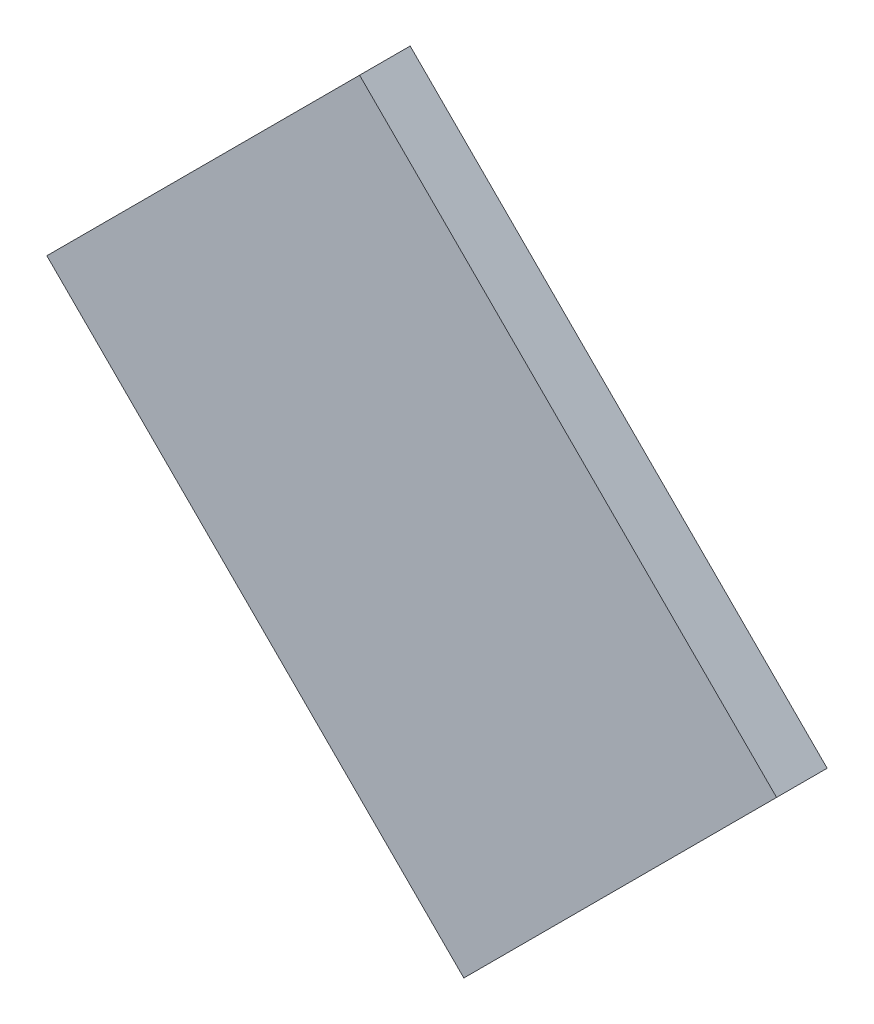
ISO-10303-21;
HEADER;
FILE_DESCRIPTION(('STEP AP214'),'2;1');
FILE_NAME('part.step','',(''),(''),'','','');
FILE_SCHEMA(('AUTOMOTIVE_DESIGN { 1 0 10303 214 1 1 1 1 }'));
ENDSEC;
DATA;
#1=APPLICATION_CONTEXT('core data for automotive mechanical design processes');
#2=APPLICATION_PROTOCOL_DEFINITION('international standard','automotive_design',2000,#1);
#3=PRODUCT_CONTEXT('',#1,'mechanical');
#4=PRODUCT('Part','Part','',(#3));
#5=PRODUCT_RELATED_PRODUCT_CATEGORY('part','',(#4));
#6=PRODUCT_DEFINITION_FORMATION('','',#4);
#7=PRODUCT_DEFINITION_CONTEXT('part definition',#1,'design');
#8=PRODUCT_DEFINITION('design','',#6,#7);
#9=PRODUCT_DEFINITION_SHAPE('','',#8);
#10=(LENGTH_UNIT() NAMED_UNIT(*) SI_UNIT(.MILLI.,.METRE.));
#11=(NAMED_UNIT(*) PLANE_ANGLE_UNIT() SI_UNIT($,.RADIAN.));
#12=(NAMED_UNIT(*) SI_UNIT($,.STERADIAN.) SOLID_ANGLE_UNIT());
#13=UNCERTAINTY_MEASURE_WITH_UNIT(LENGTH_MEASURE(1.E-05),#10,'distance_accuracy_value','');
#14=(GEOMETRIC_REPRESENTATION_CONTEXT(3) GLOBAL_UNCERTAINTY_ASSIGNED_CONTEXT((#13)) GLOBAL_UNIT_ASSIGNED_CONTEXT((#10,
#11,#12)) REPRESENTATION_CONTEXT('',''));
#15=CARTESIAN_POINT('',(0.,0.,0.));
#16=DIRECTION('',(0.,0.,1.));
#17=DIRECTION('',(1.,0.,0.));
#18=AXIS2_PLACEMENT_3D('',#15,#16,#17);
#19=CARTESIAN_POINT('',(8.2855453335,9.2085453335,0.76487));
#20=DIRECTION('',(0.,0.,-1.));
#21=DIRECTION('',(-1.,0.,0.));
#22=AXIS2_PLACEMENT_3D('',#19,#20,#21);
#23=PLANE('',#22);
#24=DIRECTION('',(0.707106781186548,0.707106781186548,0.));
#25=VECTOR('',#24,1.);
#26=CARTESIAN_POINT('',(8.038058,9.243900667,0.76487));
#27=LINE('',#26,#25);
#28=CARTESIAN_POINT('',(8.038058,9.243900667,0.76487));
#29=VERTEX_POINT('',#28);
#30=CARTESIAN_POINT('',(8.25019,9.456032667,0.76487));
#31=VERTEX_POINT('',#30);
#32=EDGE_CURVE('E55',#29,#31,#27,.T.);
#33=ORIENTED_EDGE('',*,*,#32,.T.);
#34=DIRECTION('',(0.707106781186548,-0.707106781186548,0.));
#35=VECTOR('',#34,1.);
#36=CARTESIAN_POINT('',(8.25019,9.456032667,0.76487));
#37=LINE('',#36,#35);
#38=CARTESIAN_POINT('',(8.533032667,9.17319,0.76487));
#39=VERTEX_POINT('',#38);
#40=EDGE_CURVE('E57',#31,#39,#37,.T.);
#41=ORIENTED_EDGE('',*,*,#40,.T.);
#42=DIRECTION('',(-0.707106781186548,-0.707106781186548,0.));
#43=VECTOR('',#42,1.);
#44=CARTESIAN_POINT('',(8.533032667,9.17319,0.76487));
#45=LINE('',#44,#43);
#46=CARTESIAN_POINT('',(8.320900667,8.961058,0.76487));
#47=VERTEX_POINT('',#46);
#48=EDGE_CURVE('E20',#39,#47,#45,.T.);
#49=ORIENTED_EDGE('',*,*,#48,.T.);
#50=DIRECTION('',(-0.707106781186548,0.707106781186548,0.));
#51=VECTOR('',#50,1.);
#52=CARTESIAN_POINT('',(8.320900667,8.961058,0.76487));
#53=LINE('',#52,#51);
#54=EDGE_CURVE('E80',#47,#29,#53,.T.);
#55=ORIENTED_EDGE('',*,*,#54,.T.);
#56=EDGE_LOOP('',(#33,#41,#49,#55));
#57=FACE_BOUND('',#56,.T.);
#58=ADVANCED_FACE('F17',(#57),#23,.T.);
#59=CARTESIAN_POINT('',(8.533032667,9.17319,0.76487));
#60=DIRECTION('',(-0.707106781186548,0.707106781186548,0.));
#61=DIRECTION('',(-0.707106781186548,-0.707106781186548,0.));
#62=AXIS2_PLACEMENT_3D('',#59,#60,#61);
#63=PLANE('',#62);
#64=DIRECTION('',(0.,0.,1.));
#65=VECTOR('',#64,1.);
#66=CARTESIAN_POINT('',(8.320900667,8.961058,0.76487));
#67=LINE('',#66,#65);
#68=CARTESIAN_POINT('',(8.320900667,8.961058,0.79916));
#69=VERTEX_POINT('',#68);
#70=EDGE_CURVE('E68',#69,#47,#67,.F.);
#71=ORIENTED_EDGE('',*,*,#70,.T.);
#72=ORIENTED_EDGE('',*,*,#48,.F.);
#73=DIRECTION('',(0.,0.,1.));
#74=VECTOR('',#73,1.);
#75=CARTESIAN_POINT('',(8.533032667,9.17319,0.76487));
#76=LINE('',#75,#74);
#77=CARTESIAN_POINT('',(8.533032667,9.17319,0.79916));
#78=VERTEX_POINT('',#77);
#79=EDGE_CURVE('E63',#39,#78,#76,.T.);
#80=ORIENTED_EDGE('',*,*,#79,.T.);
#81=DIRECTION('',(0.70710678118655,0.707106781186545,0.));
#82=VECTOR('',#81,1.);
#83=CARTESIAN_POINT('',(8.320900667,8.961058,0.79916));
#84=LINE('',#83,#82);
#85=EDGE_CURVE('E83',#69,#78,#84,.T.);
#86=ORIENTED_EDGE('',*,*,#85,.F.);
#87=EDGE_LOOP('',(#71,#72,#80,#86));
#88=FACE_BOUND('',#87,.T.);
#89=ADVANCED_FACE('F65',(#88),#63,.F.);
#90=CARTESIAN_POINT('',(8.25019,9.456032667,0.76487));
#91=DIRECTION('',(-0.707106781186548,-0.707106781186548,0.));
#92=DIRECTION('',(0.707106781186548,-0.707106781186548,0.));
#93=AXIS2_PLACEMENT_3D('',#90,#91,#92);
#94=PLANE('',#93);
#95=ORIENTED_EDGE('',*,*,#79,.F.);
#96=ORIENTED_EDGE('',*,*,#40,.F.);
#97=DIRECTION('',(0.,0.,1.));
#98=VECTOR('',#97,1.);
#99=CARTESIAN_POINT('',(8.25019,9.456032667,0.76487));
#100=LINE('',#99,#98);
#101=CARTESIAN_POINT('',(8.25019,9.456032667,0.79916));
#102=VERTEX_POINT('',#101);
#103=EDGE_CURVE('E75',#31,#102,#100,.T.);
#104=ORIENTED_EDGE('',*,*,#103,.T.);
#105=DIRECTION('',(-0.70710678118655,0.707106781186545,0.));
#106=VECTOR('',#105,1.);
#107=CARTESIAN_POINT('',(8.533032667,9.17319,0.79916));
#108=LINE('',#107,#106);
#109=EDGE_CURVE('E72',#78,#102,#108,.T.);
#110=ORIENTED_EDGE('',*,*,#109,.F.);
#111=EDGE_LOOP('',(#95,#96,#104,#110));
#112=FACE_BOUND('',#111,.T.);
#113=ADVANCED_FACE('F70',(#112),#94,.F.);
#114=CARTESIAN_POINT('',(8.038058,9.243900667,0.76487));
#115=DIRECTION('',(0.707106781186548,-0.707106781186548,0.));
#116=DIRECTION('',(0.707106781186548,0.707106781186548,0.));
#117=AXIS2_PLACEMENT_3D('',#114,#115,#116);
#118=PLANE('',#117);
#119=ORIENTED_EDGE('',*,*,#103,.F.);
#120=ORIENTED_EDGE('',*,*,#32,.F.);
#121=DIRECTION('',(0.,0.,1.));
#122=VECTOR('',#121,1.);
#123=CARTESIAN_POINT('',(8.038058,9.243900667,0.76487));
#124=LINE('',#123,#122);
#125=CARTESIAN_POINT('',(8.038058,9.243900667,0.79916));
#126=VERTEX_POINT('',#125);
#127=EDGE_CURVE('E35',#29,#126,#124,.T.);
#128=ORIENTED_EDGE('',*,*,#127,.T.);
#129=DIRECTION('',(-0.707106781186548,-0.707106781186548,0.));
#130=VECTOR('',#129,1.);
#131=CARTESIAN_POINT('',(8.25019,9.456032667,0.79916));
#132=LINE('',#131,#130);
#133=EDGE_CURVE('E26',#102,#126,#132,.T.);
#134=ORIENTED_EDGE('',*,*,#133,.F.);
#135=EDGE_LOOP('',(#119,#120,#128,#134));
#136=FACE_BOUND('',#135,.T.);
#137=ADVANCED_FACE('F89',(#136),#118,.F.);
#138=CARTESIAN_POINT('',(8.320900667,8.961058,0.76487));
#139=DIRECTION('',(0.707106781186548,0.707106781186548,0.));
#140=DIRECTION('',(-0.707106781186548,0.707106781186548,0.));
#141=AXIS2_PLACEMENT_3D('',#138,#139,#140);
#142=PLANE('',#141);
#143=ORIENTED_EDGE('',*,*,#127,.F.);
#144=ORIENTED_EDGE('',*,*,#54,.F.);
#145=ORIENTED_EDGE('',*,*,#70,.F.);
#146=DIRECTION('',(0.707106781186548,-0.707106781186548,0.));
#147=VECTOR('',#146,1.);
#148=CARTESIAN_POINT('',(8.038058,9.243900667,0.79916));
#149=LINE('',#148,#147);
#150=EDGE_CURVE('E11',#126,#69,#149,.T.);
#151=ORIENTED_EDGE('',*,*,#150,.F.);
#152=EDGE_LOOP('',(#143,#144,#145,#151));
#153=FACE_BOUND('',#152,.T.);
#154=ADVANCED_FACE('F91',(#153),#142,.F.);
#155=CARTESIAN_POINT('',(8.2855453335,9.2085453335,0.79916));
#156=DIRECTION('',(0.,0.,1.));
#157=DIRECTION('',(0.,-1.,0.));
#158=AXIS2_PLACEMENT_3D('',#155,#156,#157);
#159=PLANE('',#158);
#160=ORIENTED_EDGE('',*,*,#133,.T.);
#161=ORIENTED_EDGE('',*,*,#150,.T.);
#162=ORIENTED_EDGE('',*,*,#85,.T.);
#163=ORIENTED_EDGE('',*,*,#109,.T.);
#164=EDGE_LOOP('',(#160,#161,#162,#163));
#165=FACE_BOUND('',#164,.T.);
#166=ADVANCED_FACE('F88',(#165),#159,.T.);
#167=CLOSED_SHELL('',(#58,#89,#113,#137,#154,#166));
#168=MANIFOLD_SOLID_BREP('B1',#167);
#169=ADVANCED_BREP_SHAPE_REPRESENTATION('',(#18,#168),#14);
#170=SHAPE_DEFINITION_REPRESENTATION(#9,#169);
ENDSEC;
END-ISO-10303-21;
